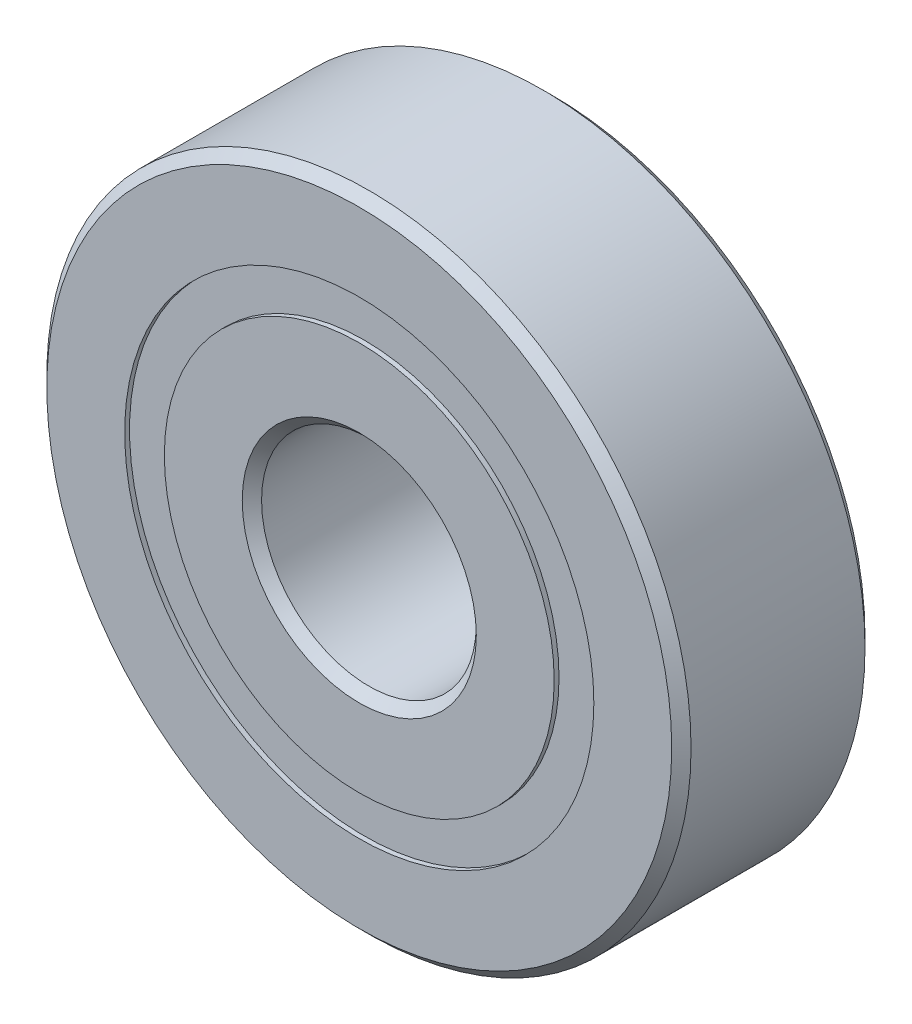
ISO-10303-21;
HEADER;
FILE_DESCRIPTION(('STEP AP214'),'2;1');
FILE_NAME('part.step','',(''),(''),'','','');
FILE_SCHEMA(('AUTOMOTIVE_DESIGN { 1 0 10303 214 1 1 1 1 }'));
ENDSEC;
DATA;
#1=APPLICATION_CONTEXT('core data for automotive mechanical design processes');
#2=APPLICATION_PROTOCOL_DEFINITION('international standard','automotive_design',2000,#1);
#3=PRODUCT_CONTEXT('',#1,'mechanical');
#4=PRODUCT('Part','Part','',(#3));
#5=PRODUCT_RELATED_PRODUCT_CATEGORY('part','',(#4));
#6=PRODUCT_DEFINITION_FORMATION('','',#4);
#7=PRODUCT_DEFINITION_CONTEXT('part definition',#1,'design');
#8=PRODUCT_DEFINITION('design','',#6,#7);
#9=PRODUCT_DEFINITION_SHAPE('','',#8);
#10=(LENGTH_UNIT() NAMED_UNIT(*) SI_UNIT(.MILLI.,.METRE.));
#11=(NAMED_UNIT(*) PLANE_ANGLE_UNIT() SI_UNIT($,.RADIAN.));
#12=(NAMED_UNIT(*) SI_UNIT($,.STERADIAN.) SOLID_ANGLE_UNIT());
#13=UNCERTAINTY_MEASURE_WITH_UNIT(LENGTH_MEASURE(1.E-05),#10,'distance_accuracy_value','');
#14=(GEOMETRIC_REPRESENTATION_CONTEXT(3) GLOBAL_UNCERTAINTY_ASSIGNED_CONTEXT((#13)) GLOBAL_UNIT_ASSIGNED_CONTEXT((#10,
#11,#12)) REPRESENTATION_CONTEXT('',''));
#15=CARTESIAN_POINT('',(0.,0.,0.));
#16=DIRECTION('',(0.,0.,1.));
#17=DIRECTION('',(1.,0.,0.));
#18=AXIS2_PLACEMENT_3D('',#15,#16,#17);
#19=CARTESIAN_POINT('',(0.,10.9230769230769,-4.275));
#20=DIRECTION('',(0.,0.,1.));
#21=DIRECTION('',(1.,0.,0.));
#22=AXIS2_PLACEMENT_3D('',#19,#20,#21);
#23=PLANE('',#22);
#24=CARTESIAN_POINT('',(0.,0.,-4.275));
#25=DIRECTION('',(0.,0.,1.));
#26=DIRECTION('',(1.,0.,0.));
#27=AXIS2_PLACEMENT_3D('',#24,#25,#26);
#28=CIRCLE('',#27,10.9230769230769);
#29=CARTESIAN_POINT('',(10.9230769230769,0.,-4.275));
#30=VERTEX_POINT('',#29);
#31=EDGE_CURVE('E60',#30,#30,#28,.T.);
#32=ORIENTED_EDGE('',*,*,#31,.F.);
#33=EDGE_LOOP('',(#32));
#34=FACE_BOUND('',#33,.T.);
#35=CARTESIAN_POINT('',(0.,0.,-4.275));
#36=DIRECTION('',(0.,0.,1.));
#37=DIRECTION('',(1.,0.,0.));
#38=AXIS2_PLACEMENT_3D('',#35,#36,#37);
#39=CIRCLE('',#38,9.07692307692308);
#40=CARTESIAN_POINT('',(9.07692307692308,0.,-4.275));
#41=VERTEX_POINT('',#40);
#42=EDGE_CURVE('E11',#41,#41,#39,.T.);
#43=ORIENTED_EDGE('',*,*,#42,.T.);
#44=EDGE_LOOP('',(#43));
#45=FACE_BOUND('',#44,.T.);
#46=ADVANCED_FACE('F46',(#34,#45),#23,.F.);
#47=CARTESIAN_POINT('',(0.,0.,4.5));
#48=DIRECTION('',(0.,0.,1.));
#49=DIRECTION('',(1.,0.,0.));
#50=AXIS2_PLACEMENT_3D('',#47,#48,#49);
#51=CYLINDRICAL_SURFACE('',#50,9.07692307692308);
#52=ORIENTED_EDGE('',*,*,#42,.F.);
#53=EDGE_LOOP('',(#52));
#54=FACE_BOUND('',#53,.T.);
#55=CARTESIAN_POINT('',(0.,0.,-2.20274170204252));
#56=DIRECTION('',(0.,0.,1.));
#57=DIRECTION('',(1.,0.,0.));
#58=AXIS2_PLACEMENT_3D('',#55,#56,#57);
#59=CIRCLE('',#58,9.07692307692308);
#60=CARTESIAN_POINT('',(9.07692307692308,0.,-2.20274170204252));
#61=VERTEX_POINT('',#60);
#62=EDGE_CURVE('E52',#61,#61,#59,.T.);
#63=ORIENTED_EDGE('',*,*,#62,.T.);
#64=EDGE_LOOP('',(#63));
#65=FACE_BOUND('',#64,.T.);
#66=ADVANCED_FACE('F69',(#54,#65),#51,.F.);
#67=CARTESIAN_POINT('',(0.,10.9230769230769,-2.20274170204252));
#68=DIRECTION('',(0.,0.,-1.));
#69=DIRECTION('',(-1.,0.,0.));
#70=AXIS2_PLACEMENT_3D('',#67,#68,#69);
#71=PLANE('',#70);
#72=ORIENTED_EDGE('',*,*,#62,.F.);
#73=EDGE_LOOP('',(#72));
#74=FACE_BOUND('',#73,.T.);
#75=CARTESIAN_POINT('',(0.,0.,-2.20274170204252));
#76=DIRECTION('',(0.,0.,1.));
#77=DIRECTION('',(1.,0.,0.));
#78=AXIS2_PLACEMENT_3D('',#75,#76,#77);
#79=CIRCLE('',#78,10.9230769230769);
#80=CARTESIAN_POINT('',(10.9230769230769,0.,-2.20274170204252));
#81=VERTEX_POINT('',#80);
#82=EDGE_CURVE('E56',#81,#81,#79,.T.);
#83=ORIENTED_EDGE('',*,*,#82,.T.);
#84=EDGE_LOOP('',(#83));
#85=FACE_BOUND('',#84,.T.);
#86=ADVANCED_FACE('F73',(#74,#85),#71,.F.);
#87=CARTESIAN_POINT('',(0.,0.,4.5));
#88=DIRECTION('',(0.,0.,1.));
#89=DIRECTION('',(1.,0.,0.));
#90=AXIS2_PLACEMENT_3D('',#87,#88,#89);
#91=CYLINDRICAL_SURFACE('',#90,10.9230769230769);
#92=ORIENTED_EDGE('',*,*,#82,.F.);
#93=EDGE_LOOP('',(#92));
#94=FACE_BOUND('',#93,.T.);
#95=ORIENTED_EDGE('',*,*,#31,.T.);
#96=EDGE_LOOP('',(#95));
#97=FACE_BOUND('',#96,.T.);
#98=ADVANCED_FACE('F66',(#94,#97),#91,.T.);
#99=CLOSED_SHELL('',(#46,#66,#86,#98));
#100=MANIFOLD_SOLID_BREP('B2',#99);
#101=CARTESIAN_POINT('',(0.,10.9230769230769,4.275));
#102=DIRECTION('',(0.,0.,-1.));
#103=DIRECTION('',(-1.,0.,0.));
#104=AXIS2_PLACEMENT_3D('',#101,#102,#103);
#105=PLANE('',#104);
#106=CARTESIAN_POINT('',(0.,0.,4.275));
#107=DIRECTION('',(0.,0.,1.));
#108=DIRECTION('',(1.,0.,0.));
#109=AXIS2_PLACEMENT_3D('',#106,#107,#108);
#110=CIRCLE('',#109,9.07692307692308);
#111=CARTESIAN_POINT('',(9.07692307692308,0.,4.275));
#112=VERTEX_POINT('',#111);
#113=EDGE_CURVE('E45',#112,#112,#110,.T.);
#114=ORIENTED_EDGE('',*,*,#113,.F.);
#115=EDGE_LOOP('',(#114));
#116=FACE_BOUND('',#115,.T.);
#117=CARTESIAN_POINT('',(0.,0.,4.275));
#118=DIRECTION('',(0.,0.,1.));
#119=DIRECTION('',(1.,0.,0.));
#120=AXIS2_PLACEMENT_3D('',#117,#118,#119);
#121=CIRCLE('',#120,10.9230769230769);
#122=CARTESIAN_POINT('',(10.9230769230769,0.,4.275));
#123=VERTEX_POINT('',#122);
#124=EDGE_CURVE('E128',#123,#123,#121,.T.);
#125=ORIENTED_EDGE('',*,*,#124,.T.);
#126=EDGE_LOOP('',(#125));
#127=FACE_BOUND('',#126,.T.);
#128=ADVANCED_FACE('F114',(#116,#127),#105,.F.);
#129=CARTESIAN_POINT('',(0.,0.,4.5));
#130=DIRECTION('',(0.,0.,1.));
#131=DIRECTION('',(1.,0.,0.));
#132=AXIS2_PLACEMENT_3D('',#129,#130,#131);
#133=CYLINDRICAL_SURFACE('',#132,9.07692307692308);
#134=CARTESIAN_POINT('',(0.,0.,2.20274170204252));
#135=DIRECTION('',(0.,0.,1.));
#136=DIRECTION('',(1.,0.,0.));
#137=AXIS2_PLACEMENT_3D('',#134,#135,#136);
#138=CIRCLE('',#137,9.07692307692308);
#139=CARTESIAN_POINT('',(9.07692307692308,0.,2.20274170204252));
#140=VERTEX_POINT('',#139);
#141=EDGE_CURVE('E120',#140,#140,#138,.T.);
#142=ORIENTED_EDGE('',*,*,#141,.F.);
#143=EDGE_LOOP('',(#142));
#144=FACE_BOUND('',#143,.T.);
#145=ORIENTED_EDGE('',*,*,#113,.T.);
#146=EDGE_LOOP('',(#145));
#147=FACE_BOUND('',#146,.T.);
#148=ADVANCED_FACE('F143',(#144,#147),#133,.F.);
#149=CARTESIAN_POINT('',(0.,10.9230769230769,2.20274170204252));
#150=DIRECTION('',(0.,0.,1.));
#151=DIRECTION('',(1.,0.,0.));
#152=AXIS2_PLACEMENT_3D('',#149,#150,#151);
#153=PLANE('',#152);
#154=CARTESIAN_POINT('',(0.,0.,2.20274170204252));
#155=DIRECTION('',(0.,0.,1.));
#156=DIRECTION('',(1.,0.,0.));
#157=AXIS2_PLACEMENT_3D('',#154,#155,#156);
#158=CIRCLE('',#157,10.9230769230769);
#159=CARTESIAN_POINT('',(10.9230769230769,0.,2.20274170204252));
#160=VERTEX_POINT('',#159);
#161=EDGE_CURVE('E124',#160,#160,#158,.T.);
#162=ORIENTED_EDGE('',*,*,#161,.F.);
#163=EDGE_LOOP('',(#162));
#164=FACE_BOUND('',#163,.T.);
#165=ORIENTED_EDGE('',*,*,#141,.T.);
#166=EDGE_LOOP('',(#165));
#167=FACE_BOUND('',#166,.T.);
#168=ADVANCED_FACE('F138',(#164,#167),#153,.F.);
#169=CARTESIAN_POINT('',(0.,0.,4.5));
#170=DIRECTION('',(0.,0.,1.));
#171=DIRECTION('',(1.,0.,0.));
#172=AXIS2_PLACEMENT_3D('',#169,#170,#171);
#173=CYLINDRICAL_SURFACE('',#172,10.9230769230769);
#174=ORIENTED_EDGE('',*,*,#124,.F.);
#175=EDGE_LOOP('',(#174));
#176=FACE_BOUND('',#175,.T.);
#177=ORIENTED_EDGE('',*,*,#161,.T.);
#178=EDGE_LOOP('',(#177));
#179=FACE_BOUND('',#178,.T.);
#180=ADVANCED_FACE('F135',(#176,#179),#173,.T.);
#181=CLOSED_SHELL('',(#128,#148,#168,#180));
#182=MANIFOLD_SOLID_BREP('B6',#181);
#183=CARTESIAN_POINT('',(-4.99999999999989,8.66025403784445,0.));
#184=DIRECTION('',(0.,0.,1.));
#185=DIRECTION('',(-0.499999999999989,0.866025403784445,0.));
#186=AXIS2_PLACEMENT_3D('',#183,#184,#185);
#187=SPHERICAL_SURFACE('',#186,2.20274170204252);
#188=CARTESIAN_POINT('',(-4.99999999999989,8.66025403784445,2.20274170204252));
#189=VERTEX_POINT('',#188);
#190=VERTEX_LOOP('',#189);
#191=FACE_BOUND('',#190,.T.);
#192=ADVANCED_FACE('F182',(#191),#187,.T.);
#193=CLOSED_SHELL('',(#192));
#194=MANIFOLD_SOLID_BREP('B40',#193);
#195=CARTESIAN_POINT('',(-8.66025403784433,5.0000000000001,0.));
#196=DIRECTION('',(0.,0.,1.));
#197=DIRECTION('',(-0.866025403784433,0.50000000000001,0.));
#198=AXIS2_PLACEMENT_3D('',#195,#196,#197);
#199=SPHERICAL_SURFACE('',#198,2.20274170204252);
#200=CARTESIAN_POINT('',(-8.66025403784433,5.0000000000001,2.20274170204252));
#201=VERTEX_POINT('',#200);
#202=VERTEX_LOOP('',#201);
#203=FACE_BOUND('',#202,.T.);
#204=ADVANCED_FACE('F203',(#203),#199,.T.);
#205=CLOSED_SHELL('',(#204));
#206=MANIFOLD_SOLID_BREP('B110',#205);
#207=CARTESIAN_POINT('',(-10.,1.04744440165294E-13,0.));
#208=DIRECTION('',(0.,0.,1.));
#209=DIRECTION('',(-1.,0.,0.));
#210=AXIS2_PLACEMENT_3D('',#207,#208,#209);
#211=SPHERICAL_SURFACE('',#210,2.20274170204252);
#212=CARTESIAN_POINT('',(-10.,1.04744440165294E-13,2.20274170204252));
#213=VERTEX_POINT('',#212);
#214=VERTEX_LOOP('',#213);
#215=FACE_BOUND('',#214,.T.);
#216=ADVANCED_FACE('F224',(#215),#211,.T.);
#217=CLOSED_SHELL('',(#216));
#218=MANIFOLD_SOLID_BREP('B178',#217);
#219=CARTESIAN_POINT('',(-8.66025403784443,-4.99999999999992,0.));
#220=DIRECTION('',(0.,0.,1.));
#221=DIRECTION('',(-0.866025403784443,-0.499999999999992,0.));
#222=AXIS2_PLACEMENT_3D('',#219,#220,#221);
#223=SPHERICAL_SURFACE('',#222,2.20274170204252);
#224=CARTESIAN_POINT('',(-8.66025403784443,-4.99999999999992,2.20274170204252));
#225=VERTEX_POINT('',#224);
#226=VERTEX_LOOP('',#225);
#227=FACE_BOUND('',#226,.T.);
#228=ADVANCED_FACE('F245',(#227),#223,.T.);
#229=CLOSED_SHELL('',(#228));
#230=MANIFOLD_SOLID_BREP('B199',#229);
#231=CARTESIAN_POINT('',(-5.00000000000007,-8.66025403784435,0.));
#232=DIRECTION('',(0.,0.,1.));
#233=DIRECTION('',(-0.500000000000007,-0.866025403784435,0.));
#234=AXIS2_PLACEMENT_3D('',#231,#232,#233);
#235=SPHERICAL_SURFACE('',#234,2.20274170204252);
#236=CARTESIAN_POINT('',(-5.00000000000007,-8.66025403784435,2.20274170204252));
#237=VERTEX_POINT('',#236);
#238=VERTEX_LOOP('',#237);
#239=FACE_BOUND('',#238,.T.);
#240=ADVANCED_FACE('F266',(#239),#235,.T.);
#241=CLOSED_SHELL('',(#240));
#242=MANIFOLD_SOLID_BREP('B220',#241);
#243=CARTESIAN_POINT('',(0.,-10.,0.));
#244=DIRECTION('',(0.,0.,1.));
#245=DIRECTION('',(0.,-1.,0.));
#246=AXIS2_PLACEMENT_3D('',#243,#244,#245);
#247=SPHERICAL_SURFACE('',#246,2.20274170204252);
#248=CARTESIAN_POINT('',(0.,-10.,2.20274170204252));
#249=VERTEX_POINT('',#248);
#250=VERTEX_LOOP('',#249);
#251=FACE_BOUND('',#250,.T.);
#252=ADVANCED_FACE('F287',(#251),#247,.T.);
#253=CLOSED_SHELL('',(#252));
#254=MANIFOLD_SOLID_BREP('B241',#253);
#255=CARTESIAN_POINT('',(4.99999999999995,-8.66025403784442,0.));
#256=DIRECTION('',(0.,0.,1.));
#257=DIRECTION('',(0.499999999999995,-0.866025403784442,0.));
#258=AXIS2_PLACEMENT_3D('',#255,#256,#257);
#259=SPHERICAL_SURFACE('',#258,2.20274170204252);
#260=CARTESIAN_POINT('',(4.99999999999995,-8.66025403784442,2.20274170204252));
#261=VERTEX_POINT('',#260);
#262=VERTEX_LOOP('',#261);
#263=FACE_BOUND('',#262,.T.);
#264=ADVANCED_FACE('F308',(#263),#259,.T.);
#265=CLOSED_SHELL('',(#264));
#266=MANIFOLD_SOLID_BREP('B262',#265);
#267=CARTESIAN_POINT('',(8.66025403784437,-5.00000000000004,0.));
#268=DIRECTION('',(0.,0.,1.));
#269=DIRECTION('',(0.866025403784436,-0.500000000000004,0.));
#270=AXIS2_PLACEMENT_3D('',#267,#268,#269);
#271=SPHERICAL_SURFACE('',#270,2.20274170204252);
#272=CARTESIAN_POINT('',(8.66025403784437,-5.00000000000004,2.20274170204252));
#273=VERTEX_POINT('',#272);
#274=VERTEX_LOOP('',#273);
#275=FACE_BOUND('',#274,.T.);
#276=ADVANCED_FACE('F329',(#275),#271,.T.);
#277=CLOSED_SHELL('',(#276));
#278=MANIFOLD_SOLID_BREP('B283',#277);
#279=CARTESIAN_POINT('',(10.,0.,0.));
#280=DIRECTION('',(0.,0.,1.));
#281=DIRECTION('',(1.,0.,0.));
#282=AXIS2_PLACEMENT_3D('',#279,#280,#281);
#283=SPHERICAL_SURFACE('',#282,2.20274170204252);
#284=CARTESIAN_POINT('',(10.,0.,2.20274170204252));
#285=VERTEX_POINT('',#284);
#286=VERTEX_LOOP('',#285);
#287=FACE_BOUND('',#286,.T.);
#288=ADVANCED_FACE('F350',(#287),#283,.T.);
#289=CLOSED_SHELL('',(#288));
#290=MANIFOLD_SOLID_BREP('B304',#289);
#291=CARTESIAN_POINT('',(8.6602540378444,4.99999999999998,0.));
#292=DIRECTION('',(0.,0.,1.));
#293=DIRECTION('',(0.86602540378444,0.499999999999998,0.));
#294=AXIS2_PLACEMENT_3D('',#291,#292,#293);
#295=SPHERICAL_SURFACE('',#294,2.20274170204252);
#296=CARTESIAN_POINT('',(8.6602540378444,4.99999999999998,2.20274170204252));
#297=VERTEX_POINT('',#296);
#298=VERTEX_LOOP('',#297);
#299=FACE_BOUND('',#298,.T.);
#300=ADVANCED_FACE('F371',(#299),#295,.T.);
#301=CLOSED_SHELL('',(#300));
#302=MANIFOLD_SOLID_BREP('B325',#301);
#303=CARTESIAN_POINT('',(5.00000000000001,8.66025403784438,0.));
#304=DIRECTION('',(0.,0.,1.));
#305=DIRECTION('',(0.500000000000001,0.866025403784438,0.));
#306=AXIS2_PLACEMENT_3D('',#303,#304,#305);
#307=SPHERICAL_SURFACE('',#306,2.20274170204252);
#308=CARTESIAN_POINT('',(5.00000000000001,8.66025403784438,2.20274170204252));
#309=VERTEX_POINT('',#308);
#310=VERTEX_LOOP('',#309);
#311=FACE_BOUND('',#310,.T.);
#312=ADVANCED_FACE('F392',(#311),#307,.T.);
#313=CLOSED_SHELL('',(#312));
#314=MANIFOLD_SOLID_BREP('B346',#313);
#315=CARTESIAN_POINT('',(0.,10.,0.));
#316=DIRECTION('',(0.,0.,1.));
#317=DIRECTION('',(0.,1.,0.));
#318=AXIS2_PLACEMENT_3D('',#315,#316,#317);
#319=SPHERICAL_SURFACE('',#318,2.20274170204252);
#320=CARTESIAN_POINT('',(0.,10.,2.20274170204252));
#321=VERTEX_POINT('',#320);
#322=VERTEX_LOOP('',#321);
#323=FACE_BOUND('',#322,.T.);
#324=ADVANCED_FACE('F415',(#323),#319,.T.);
#325=CLOSED_SHELL('',(#324));
#326=MANIFOLD_SOLID_BREP('B367',#325);
#327=CARTESIAN_POINT('',(0.,9.07692307692308,4.5));
#328=DIRECTION('',(0.,0.,-1.));
#329=DIRECTION('',(-1.,0.,0.));
#330=AXIS2_PLACEMENT_3D('',#327,#328,#329);
#331=PLANE('',#330);
#332=CARTESIAN_POINT('',(0.,0.,4.5));
#333=DIRECTION('',(0.,0.,1.));
#334=DIRECTION('',(1.,0.,0.));
#335=AXIS2_PLACEMENT_3D('',#332,#333,#334);
#336=CIRCLE('',#335,5.45);
#337=CARTESIAN_POINT('',(5.45,0.,4.5));
#338=VERTEX_POINT('',#337);
#339=EDGE_CURVE('E463',#338,#338,#336,.T.);
#340=ORIENTED_EDGE('',*,*,#339,.F.);
#341=EDGE_LOOP('',(#340));
#342=FACE_BOUND('',#341,.T.);
#343=CARTESIAN_POINT('',(0.,0.,4.5));
#344=DIRECTION('',(0.,0.,1.));
#345=DIRECTION('',(1.,0.,0.));
#346=AXIS2_PLACEMENT_3D('',#343,#344,#345);
#347=CIRCLE('',#346,9.07692307692308);
#348=CARTESIAN_POINT('',(9.07692307692308,0.,4.5));
#349=VERTEX_POINT('',#348);
#350=EDGE_CURVE('E414',#349,#349,#347,.T.);
#351=ORIENTED_EDGE('',*,*,#350,.T.);
#352=EDGE_LOOP('',(#351));
#353=FACE_BOUND('',#352,.T.);
#354=ADVANCED_FACE('F435',(#342,#353),#331,.F.);
#355=CARTESIAN_POINT('',(0.,0.,4.5));
#356=DIRECTION('',(0.,0.,1.));
#357=DIRECTION('',(1.,0.,0.));
#358=AXIS2_PLACEMENT_3D('',#355,#356,#357);
#359=CYLINDRICAL_SURFACE('',#358,9.07692307692308);
#360=ORIENTED_EDGE('',*,*,#350,.F.);
#361=EDGE_LOOP('',(#360));
#362=FACE_BOUND('',#361,.T.);
#363=CARTESIAN_POINT('',(0.,0.,2.));
#364=DIRECTION('',(0.,0.,1.));
#365=DIRECTION('',(1.,0.,0.));
#366=AXIS2_PLACEMENT_3D('',#363,#364,#365);
#367=CIRCLE('',#366,9.07692307692308);
#368=CARTESIAN_POINT('',(9.07692307692308,0.,2.));
#369=VERTEX_POINT('',#368);
#370=EDGE_CURVE('E441',#369,#369,#367,.T.);
#371=ORIENTED_EDGE('',*,*,#370,.T.);
#372=EDGE_LOOP('',(#371));
#373=FACE_BOUND('',#372,.T.);
#374=ADVANCED_FACE('F470',(#362,#373),#359,.T.);
#375=CARTESIAN_POINT('',(0.,0.,0.));
#376=DIRECTION('',(0.,0.,1.));
#377=DIRECTION('',(1.,0.,0.));
#378=AXIS2_PLACEMENT_3D('',#375,#376,#377);
#379=TOROIDAL_SURFACE('',#378,10.,2.20274170204251);
#380=ORIENTED_EDGE('',*,*,#370,.F.);
#381=EDGE_LOOP('',(#380));
#382=FACE_BOUND('',#381,.T.);
#383=CARTESIAN_POINT('',(0.,0.,-2.));
#384=DIRECTION('',(0.,0.,1.));
#385=DIRECTION('',(1.,0.,0.));
#386=AXIS2_PLACEMENT_3D('',#383,#384,#385);
#387=CIRCLE('',#386,9.07692307692308);
#388=CARTESIAN_POINT('',(9.07692307692308,0.,-2.));
#389=VERTEX_POINT('',#388);
#390=EDGE_CURVE('E445',#389,#389,#387,.T.);
#391=ORIENTED_EDGE('',*,*,#390,.T.);
#392=EDGE_LOOP('',(#391));
#393=FACE_BOUND('',#392,.T.);
#394=ADVANCED_FACE('F474',(#382,#393),#379,.F.);
#395=CARTESIAN_POINT('',(0.,0.,4.5));
#396=DIRECTION('',(0.,0.,1.));
#397=DIRECTION('',(1.,0.,0.));
#398=AXIS2_PLACEMENT_3D('',#395,#396,#397);
#399=CYLINDRICAL_SURFACE('',#398,9.07692307692308);
#400=ORIENTED_EDGE('',*,*,#390,.F.);
#401=EDGE_LOOP('',(#400));
#402=FACE_BOUND('',#401,.T.);
#403=CARTESIAN_POINT('',(0.,0.,-4.5));
#404=DIRECTION('',(0.,0.,1.));
#405=DIRECTION('',(1.,0.,0.));
#406=AXIS2_PLACEMENT_3D('',#403,#404,#405);
#407=CIRCLE('',#406,9.07692307692308);
#408=CARTESIAN_POINT('',(9.07692307692308,0.,-4.5));
#409=VERTEX_POINT('',#408);
#410=EDGE_CURVE('E449',#409,#409,#407,.T.);
#411=ORIENTED_EDGE('',*,*,#410,.T.);
#412=EDGE_LOOP('',(#411));
#413=FACE_BOUND('',#412,.T.);
#414=ADVANCED_FACE('F479',(#402,#413),#399,.T.);
#415=CARTESIAN_POINT('',(0.,5.45,-4.5));
#416=DIRECTION('',(0.,0.,1.));
#417=DIRECTION('',(1.,0.,0.));
#418=AXIS2_PLACEMENT_3D('',#415,#416,#417);
#419=PLANE('',#418);
#420=ORIENTED_EDGE('',*,*,#410,.F.);
#421=EDGE_LOOP('',(#420));
#422=FACE_BOUND('',#421,.T.);
#423=CARTESIAN_POINT('',(0.,0.,-4.5));
#424=DIRECTION('',(0.,0.,1.));
#425=DIRECTION('',(1.,0.,0.));
#426=AXIS2_PLACEMENT_3D('',#423,#424,#425);
#427=CIRCLE('',#426,5.45);
#428=CARTESIAN_POINT('',(5.45,0.,-4.5));
#429=VERTEX_POINT('',#428);
#430=EDGE_CURVE('E454',#429,#429,#427,.T.);
#431=ORIENTED_EDGE('',*,*,#430,.T.);
#432=EDGE_LOOP('',(#431));
#433=FACE_BOUND('',#432,.T.);
#434=ADVANCED_FACE('F485',(#422,#433),#419,.F.);
#435=CARTESIAN_POINT('',(0.,0.,-4.05));
#436=DIRECTION('',(0.,0.,-1.));
#437=DIRECTION('',(-1.,0.,0.));
#438=AXIS2_PLACEMENT_3D('',#435,#436,#437);
#439=CONICAL_SURFACE('',#438,5.,0.785398163397445);
#440=ORIENTED_EDGE('',*,*,#430,.F.);
#441=EDGE_LOOP('',(#440));
#442=FACE_BOUND('',#441,.T.);
#443=CARTESIAN_POINT('',(0.,0.,-4.05));
#444=DIRECTION('',(0.,0.,1.));
#445=DIRECTION('',(1.,0.,0.));
#446=AXIS2_PLACEMENT_3D('',#443,#444,#445);
#447=CIRCLE('',#446,5.);
#448=CARTESIAN_POINT('',(5.,0.,-4.05));
#449=VERTEX_POINT('',#448);
#450=EDGE_CURVE('E457',#449,#449,#447,.T.);
#451=ORIENTED_EDGE('',*,*,#450,.T.);
#452=EDGE_LOOP('',(#451));
#453=FACE_BOUND('',#452,.T.);
#454=ADVANCED_FACE('F489',(#442,#453),#439,.F.);
#455=CARTESIAN_POINT('',(0.,0.,4.5));
#456=DIRECTION('',(0.,0.,1.));
#457=DIRECTION('',(1.,0.,0.));
#458=AXIS2_PLACEMENT_3D('',#455,#456,#457);
#459=CYLINDRICAL_SURFACE('',#458,5.);
#460=ORIENTED_EDGE('',*,*,#450,.F.);
#461=EDGE_LOOP('',(#460));
#462=FACE_BOUND('',#461,.T.);
#463=CARTESIAN_POINT('',(0.,0.,4.05000000000001));
#464=DIRECTION('',(0.,0.,1.));
#465=DIRECTION('',(1.,0.,0.));
#466=AXIS2_PLACEMENT_3D('',#463,#464,#465);
#467=CIRCLE('',#466,5.);
#468=CARTESIAN_POINT('',(5.,0.,4.05000000000001));
#469=VERTEX_POINT('',#468);
#470=EDGE_CURVE('E460',#469,#469,#467,.T.);
#471=ORIENTED_EDGE('',*,*,#470,.T.);
#472=EDGE_LOOP('',(#471));
#473=FACE_BOUND('',#472,.T.);
#474=ADVANCED_FACE('F493',(#462,#473),#459,.F.);
#475=CARTESIAN_POINT('',(0.,0.,4.5));
#476=DIRECTION('',(0.,0.,1.));
#477=DIRECTION('',(1.,0.,0.));
#478=AXIS2_PLACEMENT_3D('',#475,#476,#477);
#479=CONICAL_SURFACE('',#478,5.45,0.785398163397452);
#480=ORIENTED_EDGE('',*,*,#470,.F.);
#481=EDGE_LOOP('',(#480));
#482=FACE_BOUND('',#481,.T.);
#483=ORIENTED_EDGE('',*,*,#339,.T.);
#484=EDGE_LOOP('',(#483));
#485=FACE_BOUND('',#484,.T.);
#486=ADVANCED_FACE('F467',(#482,#485),#479,.F.);
#487=CLOSED_SHELL('',(#354,#374,#394,#414,#434,#454,#474,#486));
#488=MANIFOLD_SOLID_BREP('B388',#487);
#489=CARTESIAN_POINT('',(0.,0.,4.05));
#490=DIRECTION('',(0.,0.,-1.));
#491=DIRECTION('',(-1.,0.,0.));
#492=AXIS2_PLACEMENT_3D('',#489,#490,#491);
#493=CONICAL_SURFACE('',#492,15.,0.785398163397444);
#494=CARTESIAN_POINT('',(0.,0.,4.5));
#495=DIRECTION('',(0.,0.,1.));
#496=DIRECTION('',(1.,0.,0.));
#497=AXIS2_PLACEMENT_3D('',#494,#495,#496);
#498=CIRCLE('',#497,14.55);
#499=CARTESIAN_POINT('',(14.55,0.,4.5));
#500=VERTEX_POINT('',#499);
#501=EDGE_CURVE('E585',#500,#500,#498,.T.);
#502=ORIENTED_EDGE('',*,*,#501,.F.);
#503=EDGE_LOOP('',(#502));
#504=FACE_BOUND('',#503,.T.);
#505=CARTESIAN_POINT('',(0.,0.,4.05));
#506=DIRECTION('',(0.,0.,1.));
#507=DIRECTION('',(1.,0.,0.));
#508=AXIS2_PLACEMENT_3D('',#505,#506,#507);
#509=CIRCLE('',#508,15.);
#510=CARTESIAN_POINT('',(15.,0.,4.05));
#511=VERTEX_POINT('',#510);
#512=EDGE_CURVE('E434',#511,#511,#509,.T.);
#513=ORIENTED_EDGE('',*,*,#512,.T.);
#514=EDGE_LOOP('',(#513));
#515=FACE_BOUND('',#514,.T.);
#516=ADVANCED_FACE('F557',(#504,#515),#493,.T.);
#517=CARTESIAN_POINT('',(0.,0.,4.5));
#518=DIRECTION('',(0.,0.,1.));
#519=DIRECTION('',(1.,0.,0.));
#520=AXIS2_PLACEMENT_3D('',#517,#518,#519);
#521=CYLINDRICAL_SURFACE('',#520,15.);
#522=ORIENTED_EDGE('',*,*,#512,.F.);
#523=EDGE_LOOP('',(#522));
#524=FACE_BOUND('',#523,.T.);
#525=CARTESIAN_POINT('',(0.,0.,-4.05));
#526=DIRECTION('',(0.,0.,1.));
#527=DIRECTION('',(1.,0.,0.));
#528=AXIS2_PLACEMENT_3D('',#525,#526,#527);
#529=CIRCLE('',#528,15.);
#530=CARTESIAN_POINT('',(15.,0.,-4.05));
#531=VERTEX_POINT('',#530);
#532=EDGE_CURVE('E563',#531,#531,#529,.T.);
#533=ORIENTED_EDGE('',*,*,#532,.T.);
#534=EDGE_LOOP('',(#533));
#535=FACE_BOUND('',#534,.T.);
#536=ADVANCED_FACE('F592',(#524,#535),#521,.T.);
#537=CARTESIAN_POINT('',(0.,0.,-4.5));
#538=DIRECTION('',(0.,0.,1.));
#539=DIRECTION('',(1.,0.,0.));
#540=AXIS2_PLACEMENT_3D('',#537,#538,#539);
#541=CONICAL_SURFACE('',#540,14.55,0.785398163397443);
#542=ORIENTED_EDGE('',*,*,#532,.F.);
#543=EDGE_LOOP('',(#542));
#544=FACE_BOUND('',#543,.T.);
#545=CARTESIAN_POINT('',(0.,0.,-4.5));
#546=DIRECTION('',(0.,0.,1.));
#547=DIRECTION('',(1.,0.,0.));
#548=AXIS2_PLACEMENT_3D('',#545,#546,#547);
#549=CIRCLE('',#548,14.55);
#550=CARTESIAN_POINT('',(14.55,0.,-4.5));
#551=VERTEX_POINT('',#550);
#552=EDGE_CURVE('E567',#551,#551,#549,.T.);
#553=ORIENTED_EDGE('',*,*,#552,.T.);
#554=EDGE_LOOP('',(#553));
#555=FACE_BOUND('',#554,.T.);
#556=ADVANCED_FACE('F596',(#544,#555),#541,.T.);
#557=CARTESIAN_POINT('',(0.,14.55,-4.5));
#558=DIRECTION('',(0.,0.,1.));
#559=DIRECTION('',(1.,0.,0.));
#560=AXIS2_PLACEMENT_3D('',#557,#558,#559);
#561=PLANE('',#560);
#562=ORIENTED_EDGE('',*,*,#552,.F.);
#563=EDGE_LOOP('',(#562));
#564=FACE_BOUND('',#563,.T.);
#565=CARTESIAN_POINT('',(0.,0.,-4.5));
#566=DIRECTION('',(0.,0.,1.));
#567=DIRECTION('',(1.,0.,0.));
#568=AXIS2_PLACEMENT_3D('',#565,#566,#567);
#569=CIRCLE('',#568,10.9230769230769);
#570=CARTESIAN_POINT('',(10.9230769230769,0.,-4.5));
#571=VERTEX_POINT('',#570);
#572=EDGE_CURVE('E571',#571,#571,#569,.T.);
#573=ORIENTED_EDGE('',*,*,#572,.T.);
#574=EDGE_LOOP('',(#573));
#575=FACE_BOUND('',#574,.T.);
#576=ADVANCED_FACE('F601',(#564,#575),#561,.F.);
#577=CARTESIAN_POINT('',(0.,0.,4.5));
#578=DIRECTION('',(0.,0.,1.));
#579=DIRECTION('',(1.,0.,0.));
#580=AXIS2_PLACEMENT_3D('',#577,#578,#579);
#581=CYLINDRICAL_SURFACE('',#580,10.9230769230769);
#582=ORIENTED_EDGE('',*,*,#572,.F.);
#583=EDGE_LOOP('',(#582));
#584=FACE_BOUND('',#583,.T.);
#585=CARTESIAN_POINT('',(0.,0.,-2.));
#586=DIRECTION('',(0.,0.,1.));
#587=DIRECTION('',(1.,0.,0.));
#588=AXIS2_PLACEMENT_3D('',#585,#586,#587);
#589=CIRCLE('',#588,10.9230769230769);
#590=CARTESIAN_POINT('',(10.9230769230769,0.,-2.));
#591=VERTEX_POINT('',#590);
#592=EDGE_CURVE('E576',#591,#591,#589,.T.);
#593=ORIENTED_EDGE('',*,*,#592,.T.);
#594=EDGE_LOOP('',(#593));
#595=FACE_BOUND('',#594,.T.);
#596=ADVANCED_FACE('F607',(#584,#595),#581,.F.);
#597=CARTESIAN_POINT('',(0.,0.,0.));
#598=DIRECTION('',(0.,0.,1.));
#599=DIRECTION('',(1.,0.,0.));
#600=AXIS2_PLACEMENT_3D('',#597,#598,#599);
#601=TOROIDAL_SURFACE('',#600,10.,2.20274170204252);
#602=ORIENTED_EDGE('',*,*,#592,.F.);
#603=EDGE_LOOP('',(#602));
#604=FACE_BOUND('',#603,.T.);
#605=CARTESIAN_POINT('',(0.,0.,2.));
#606=DIRECTION('',(0.,0.,1.));
#607=DIRECTION('',(1.,0.,0.));
#608=AXIS2_PLACEMENT_3D('',#605,#606,#607);
#609=CIRCLE('',#608,10.9230769230769);
#610=CARTESIAN_POINT('',(10.9230769230769,0.,2.));
#611=VERTEX_POINT('',#610);
#612=EDGE_CURVE('E579',#611,#611,#609,.T.);
#613=ORIENTED_EDGE('',*,*,#612,.T.);
#614=EDGE_LOOP('',(#613));
#615=FACE_BOUND('',#614,.T.);
#616=ADVANCED_FACE('F611',(#604,#615),#601,.F.);
#617=CARTESIAN_POINT('',(0.,0.,4.5));
#618=DIRECTION('',(0.,0.,1.));
#619=DIRECTION('',(1.,0.,0.));
#620=AXIS2_PLACEMENT_3D('',#617,#618,#619);
#621=CYLINDRICAL_SURFACE('',#620,10.9230769230769);
#622=ORIENTED_EDGE('',*,*,#612,.F.);
#623=EDGE_LOOP('',(#622));
#624=FACE_BOUND('',#623,.T.);
#625=CARTESIAN_POINT('',(0.,0.,4.5));
#626=DIRECTION('',(0.,0.,1.));
#627=DIRECTION('',(1.,0.,0.));
#628=AXIS2_PLACEMENT_3D('',#625,#626,#627);
#629=CIRCLE('',#628,10.9230769230769);
#630=CARTESIAN_POINT('',(10.9230769230769,0.,4.5));
#631=VERTEX_POINT('',#630);
#632=EDGE_CURVE('E582',#631,#631,#629,.T.);
#633=ORIENTED_EDGE('',*,*,#632,.T.);
#634=EDGE_LOOP('',(#633));
#635=FACE_BOUND('',#634,.T.);
#636=ADVANCED_FACE('F615',(#624,#635),#621,.F.);
#637=CARTESIAN_POINT('',(0.,14.55,4.5));
#638=DIRECTION('',(0.,0.,-1.));
#639=DIRECTION('',(-1.,0.,0.));
#640=AXIS2_PLACEMENT_3D('',#637,#638,#639);
#641=PLANE('',#640);
#642=ORIENTED_EDGE('',*,*,#632,.F.);
#643=EDGE_LOOP('',(#642));
#644=FACE_BOUND('',#643,.T.);
#645=ORIENTED_EDGE('',*,*,#501,.T.);
#646=EDGE_LOOP('',(#645));
#647=FACE_BOUND('',#646,.T.);
#648=ADVANCED_FACE('F589',(#644,#647),#641,.F.);
#649=CLOSED_SHELL('',(#516,#536,#556,#576,#596,#616,#636,#648));
#650=MANIFOLD_SOLID_BREP('B409',#649);
#651=ADVANCED_BREP_SHAPE_REPRESENTATION('',(#18,#100,#182,#194,#206,#218,#230,#242,#254,#266,
#278,#290,#302,#314,#326,#488,#650),#14);
#652=SHAPE_DEFINITION_REPRESENTATION(#9,#651);
ENDSEC;
END-ISO-10303-21;
